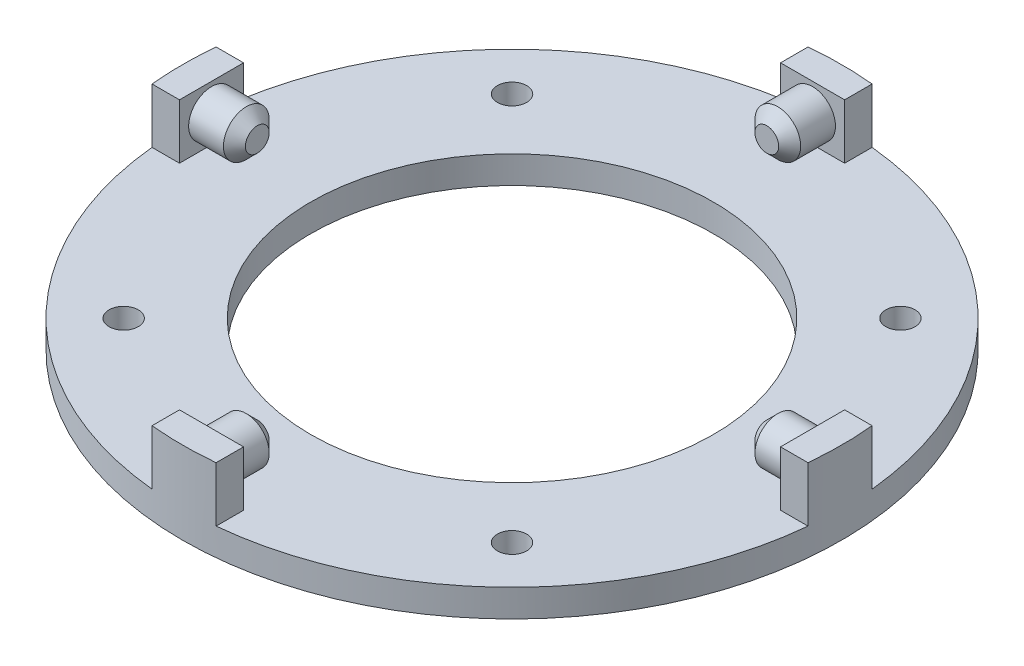
ISO-10303-21;
HEADER;
FILE_DESCRIPTION(('STEP AP214'),'2;1');
FILE_NAME('part.step','',(''),(''),'','','');
FILE_SCHEMA(('AUTOMOTIVE_DESIGN { 1 0 10303 214 1 1 1 1 }'));
ENDSEC;
DATA;
#1=APPLICATION_CONTEXT('core data for automotive mechanical design processes');
#2=APPLICATION_PROTOCOL_DEFINITION('international standard','automotive_design',2000,#1);
#3=PRODUCT_CONTEXT('',#1,'mechanical');
#4=PRODUCT('Part','Part','',(#3));
#5=PRODUCT_RELATED_PRODUCT_CATEGORY('part','',(#4));
#6=PRODUCT_DEFINITION_FORMATION('','',#4);
#7=PRODUCT_DEFINITION_CONTEXT('part definition',#1,'design');
#8=PRODUCT_DEFINITION('design','',#6,#7);
#9=PRODUCT_DEFINITION_SHAPE('','',#8);
#10=(LENGTH_UNIT() NAMED_UNIT(*) SI_UNIT(.MILLI.,.METRE.));
#11=(NAMED_UNIT(*) PLANE_ANGLE_UNIT() SI_UNIT($,.RADIAN.));
#12=(NAMED_UNIT(*) SI_UNIT($,.STERADIAN.) SOLID_ANGLE_UNIT());
#13=UNCERTAINTY_MEASURE_WITH_UNIT(LENGTH_MEASURE(1.E-05),#10,'distance_accuracy_value','');
#14=(GEOMETRIC_REPRESENTATION_CONTEXT(3) GLOBAL_UNCERTAINTY_ASSIGNED_CONTEXT((#13)) GLOBAL_UNIT_ASSIGNED_CONTEXT((#10,
#11,#12)) REPRESENTATION_CONTEXT('',''));
#15=CARTESIAN_POINT('',(0.,0.,0.));
#16=DIRECTION('',(0.,0.,1.));
#17=DIRECTION('',(1.,0.,0.));
#18=AXIS2_PLACEMENT_3D('',#15,#16,#17);
#19=CARTESIAN_POINT('',(0.,3.,0.));
#20=DIRECTION('',(0.,1.,0.));
#21=DIRECTION('',(0.,0.,1.));
#22=AXIS2_PLACEMENT_3D('',#19,#20,#21);
#23=PLANE('',#22);
#24=CARTESIAN_POINT('',(-21.2132034355965,3.,21.2132034355964));
#25=DIRECTION('',(0.,1.,0.));
#26=DIRECTION('',(1.,0.,0.));
#27=AXIS2_PLACEMENT_3D('',#24,#25,#26);
#28=CIRCLE('',#27,1.6);
#29=CARTESIAN_POINT('',(-19.6132034355965,3.,21.2132034355964));
#30=VERTEX_POINT('',#29);
#31=EDGE_CURVE('E495',#30,#30,#28,.T.);
#32=ORIENTED_EDGE('',*,*,#31,.F.);
#33=EDGE_LOOP('',(#32));
#34=FACE_BOUND('',#33,.T.);
#35=CARTESIAN_POINT('',(21.2132034355963,3.,21.2132034355965));
#36=DIRECTION('',(0.,1.,0.));
#37=DIRECTION('',(0.,0.,-1.));
#38=AXIS2_PLACEMENT_3D('',#35,#36,#37);
#39=CIRCLE('',#38,1.6);
#40=CARTESIAN_POINT('',(21.2132034355963,3.,19.6132034355965));
#41=VERTEX_POINT('',#40);
#42=EDGE_CURVE('E488',#41,#41,#39,.T.);
#43=ORIENTED_EDGE('',*,*,#42,.F.);
#44=EDGE_LOOP('',(#43));
#45=FACE_BOUND('',#44,.T.);
#46=CARTESIAN_POINT('',(21.2132034355963,3.,-21.2132034355965));
#47=DIRECTION('',(0.,1.,0.));
#48=DIRECTION('',(-1.,0.,0.));
#49=AXIS2_PLACEMENT_3D('',#46,#47,#48);
#50=CIRCLE('',#49,1.6);
#51=CARTESIAN_POINT('',(19.6132034355963,3.,-21.2132034355965));
#52=VERTEX_POINT('',#51);
#53=EDGE_CURVE('E489',#52,#52,#50,.T.);
#54=ORIENTED_EDGE('',*,*,#53,.F.);
#55=EDGE_LOOP('',(#54));
#56=FACE_BOUND('',#55,.T.);
#57=CARTESIAN_POINT('',(-21.2132034355963,3.,-21.2132034355965));
#58=DIRECTION('',(0.,1.,0.));
#59=DIRECTION('',(0.,0.,1.));
#60=AXIS2_PLACEMENT_3D('',#57,#58,#59);
#61=CIRCLE('',#60,1.6);
#62=CARTESIAN_POINT('',(-21.2132034355963,3.,-19.6132034355965));
#63=VERTEX_POINT('',#62);
#64=EDGE_CURVE('E477',#63,#63,#61,.T.);
#65=ORIENTED_EDGE('',*,*,#64,.F.);
#66=EDGE_LOOP('',(#65));
#67=FACE_BOUND('',#66,.T.);
#68=CARTESIAN_POINT('',(0.,3.,0.));
#69=DIRECTION('',(0.,1.,0.));
#70=DIRECTION('',(0.,0.,1.));
#71=AXIS2_PLACEMENT_3D('',#68,#69,#70);
#72=CIRCLE('',#71,22.);
#73=CARTESIAN_POINT('',(0.,3.,22.));
#74=VERTEX_POINT('',#73);
#75=EDGE_CURVE('E268',#74,#74,#72,.T.);
#76=ORIENTED_EDGE('',*,*,#75,.F.);
#77=EDGE_LOOP('',(#76));
#78=FACE_BOUND('',#77,.T.);
#79=DIRECTION('',(-1.,0.,0.));
#80=VECTOR('',#79,1.);
#81=CARTESIAN_POINT('',(-3.50000000000034,3.,32.8294571546932));
#82=LINE('',#81,#80);
#83=CARTESIAN_POINT('',(3.49999999999966,3.,32.8294571546933));
#84=VERTEX_POINT('',#83);
#85=CARTESIAN_POINT('',(-3.50000000000034,3.,32.8294571546932));
#86=VERTEX_POINT('',#85);
#87=EDGE_CURVE('E51',#84,#86,#82,.T.);
#88=ORIENTED_EDGE('',*,*,#87,.F.);
#89=DIRECTION('',(0.,0.,-1.));
#90=VECTOR('',#89,1.);
#91=CARTESIAN_POINT('',(3.49999999999966,3.,32.8294571546933));
#92=LINE('',#91,#90);
#93=CARTESIAN_POINT('',(3.49999999999962,3.,35.8294571546933));
#94=VERTEX_POINT('',#93);
#95=EDGE_CURVE('E469',#94,#84,#92,.T.);
#96=ORIENTED_EDGE('',*,*,#95,.F.);
#97=CARTESIAN_POINT('',(0.,3.,0.));
#98=DIRECTION('',(0.,1.,0.));
#99=DIRECTION('',(0.,0.,1.));
#100=AXIS2_PLACEMENT_3D('',#97,#98,#99);
#101=CIRCLE('',#100,36.);
#102=CARTESIAN_POINT('',(35.8294571546933,3.,3.5));
#103=VERTEX_POINT('',#102);
#104=EDGE_CURVE('E172',#94,#103,#101,.T.);
#105=ORIENTED_EDGE('',*,*,#104,.T.);
#106=DIRECTION('',(1.,0.,0.));
#107=VECTOR('',#106,1.);
#108=CARTESIAN_POINT('',(32.8294571546933,3.,3.5));
#109=LINE('',#108,#107);
#110=CARTESIAN_POINT('',(32.8294571546933,3.,3.5));
#111=VERTEX_POINT('',#110);
#112=EDGE_CURVE('E186',#111,#103,#109,.T.);
#113=ORIENTED_EDGE('',*,*,#112,.F.);
#114=DIRECTION('',(0.,0.,1.));
#115=VECTOR('',#114,1.);
#116=CARTESIAN_POINT('',(32.8294571546933,3.,3.5));
#117=LINE('',#116,#115);
#118=CARTESIAN_POINT('',(32.8294571546933,3.,-3.5));
#119=VERTEX_POINT('',#118);
#120=EDGE_CURVE('E176',#119,#111,#117,.T.);
#121=ORIENTED_EDGE('',*,*,#120,.F.);
#122=DIRECTION('',(-1.,0.,0.));
#123=VECTOR('',#122,1.);
#124=CARTESIAN_POINT('',(32.8294571546933,3.,-3.5));
#125=LINE('',#124,#123);
#126=CARTESIAN_POINT('',(35.8294571546933,3.,-3.5));
#127=VERTEX_POINT('',#126);
#128=EDGE_CURVE('E173',#127,#119,#125,.T.);
#129=ORIENTED_EDGE('',*,*,#128,.F.);
#130=CARTESIAN_POINT('',(3.50000000000012,3.,-35.8294571546932));
#131=VERTEX_POINT('',#130);
#132=EDGE_CURVE('E760',#127,#131,#101,.T.);
#133=ORIENTED_EDGE('',*,*,#132,.T.);
#134=DIRECTION('',(0.,0.,-1.));
#135=VECTOR('',#134,1.);
#136=CARTESIAN_POINT('',(3.50000000000011,3.,-32.8294571546932));
#137=LINE('',#136,#135);
#138=CARTESIAN_POINT('',(3.50000000000011,3.,-32.8294571546932));
#139=VERTEX_POINT('',#138);
#140=EDGE_CURVE('E212',#139,#131,#137,.T.);
#141=ORIENTED_EDGE('',*,*,#140,.F.);
#142=DIRECTION('',(1.,0.,0.));
#143=VECTOR('',#142,1.);
#144=CARTESIAN_POINT('',(3.50000000000011,3.,-32.8294571546932));
#145=LINE('',#144,#143);
#146=CARTESIAN_POINT('',(-3.49999999999989,3.,-32.8294571546933));
#147=VERTEX_POINT('',#146);
#148=EDGE_CURVE('E221',#147,#139,#145,.T.);
#149=ORIENTED_EDGE('',*,*,#148,.F.);
#150=DIRECTION('',(0.,0.,1.));
#151=VECTOR('',#150,1.);
#152=CARTESIAN_POINT('',(-3.49999999999989,3.,-32.8294571546933));
#153=LINE('',#152,#151);
#154=CARTESIAN_POINT('',(-3.49999999999988,3.,-35.8294571546933));
#155=VERTEX_POINT('',#154);
#156=EDGE_CURVE('E207',#155,#147,#153,.T.);
#157=ORIENTED_EDGE('',*,*,#156,.F.);
#158=CARTESIAN_POINT('',(-35.8294571546933,3.,-3.5));
#159=VERTEX_POINT('',#158);
#160=EDGE_CURVE('E277',#155,#159,#101,.T.);
#161=ORIENTED_EDGE('',*,*,#160,.T.);
#162=DIRECTION('',(-1.,0.,0.));
#163=VECTOR('',#162,1.);
#164=CARTESIAN_POINT('',(-32.8294571546933,3.,-3.5));
#165=LINE('',#164,#163);
#166=CARTESIAN_POINT('',(-32.8294571546933,3.,-3.5));
#167=VERTEX_POINT('',#166);
#168=EDGE_CURVE('E242',#167,#159,#165,.T.);
#169=ORIENTED_EDGE('',*,*,#168,.F.);
#170=DIRECTION('',(0.,0.,-1.));
#171=VECTOR('',#170,1.);
#172=CARTESIAN_POINT('',(-32.8294571546933,3.,-3.5));
#173=LINE('',#172,#171);
#174=CARTESIAN_POINT('',(-32.8294571546933,3.,3.5));
#175=VERTEX_POINT('',#174);
#176=EDGE_CURVE('E251',#175,#167,#173,.T.);
#177=ORIENTED_EDGE('',*,*,#176,.F.);
#178=DIRECTION('',(1.,0.,0.));
#179=VECTOR('',#178,1.);
#180=CARTESIAN_POINT('',(-32.8294571546933,3.,3.5));
#181=LINE('',#180,#179);
#182=CARTESIAN_POINT('',(-35.8294571546933,3.,3.5));
#183=VERTEX_POINT('',#182);
#184=EDGE_CURVE('E237',#183,#175,#181,.T.);
#185=ORIENTED_EDGE('',*,*,#184,.F.);
#186=CARTESIAN_POINT('',(-3.50000000000038,3.,35.8294571546932));
#187=VERTEX_POINT('',#186);
#188=EDGE_CURVE('E274',#183,#187,#101,.T.);
#189=ORIENTED_EDGE('',*,*,#188,.T.);
#190=DIRECTION('',(0.,0.,1.));
#191=VECTOR('',#190,1.);
#192=CARTESIAN_POINT('',(-3.50000000000034,3.,32.8294571546932));
#193=LINE('',#192,#191);
#194=EDGE_CURVE('E56',#86,#187,#193,.T.);
#195=ORIENTED_EDGE('',*,*,#194,.F.);
#196=EDGE_LOOP('',(#88,#96,#105,#113,#121,#129,#133,#141,#149,#157,#161,#169,#177,#185,#189,#195));
#197=FACE_BOUND('',#196,.T.);
#198=ADVANCED_FACE('F35',(#34,#45,#56,#67,#78,#197),#23,.T.);
#199=CARTESIAN_POINT('',(0.,0.,0.));
#200=DIRECTION('',(0.,1.,0.));
#201=DIRECTION('',(0.,0.,1.));
#202=AXIS2_PLACEMENT_3D('',#199,#200,#201);
#203=PLANE('',#202);
#204=CARTESIAN_POINT('',(-21.2132034355965,0.,21.2132034355964));
#205=DIRECTION('',(0.,1.,0.));
#206=DIRECTION('',(0.,0.,1.));
#207=AXIS2_PLACEMENT_3D('',#204,#205,#206);
#208=CIRCLE('',#207,1.6);
#209=CARTESIAN_POINT('',(-21.2132034355965,0.,22.8132034355964));
#210=VERTEX_POINT('',#209);
#211=EDGE_CURVE('E482',#210,#210,#208,.F.);
#212=ORIENTED_EDGE('',*,*,#211,.F.);
#213=EDGE_LOOP('',(#212));
#214=FACE_BOUND('',#213,.T.);
#215=CARTESIAN_POINT('',(21.2132034355963,0.,21.2132034355965));
#216=DIRECTION('',(0.,1.,0.));
#217=DIRECTION('',(0.,0.,1.));
#218=AXIS2_PLACEMENT_3D('',#215,#216,#217);
#219=CIRCLE('',#218,1.6);
#220=CARTESIAN_POINT('',(21.2132034355963,0.,22.8132034355965));
#221=VERTEX_POINT('',#220);
#222=EDGE_CURVE('E492',#221,#221,#219,.F.);
#223=ORIENTED_EDGE('',*,*,#222,.F.);
#224=EDGE_LOOP('',(#223));
#225=FACE_BOUND('',#224,.T.);
#226=CARTESIAN_POINT('',(21.2132034355963,0.,-21.2132034355965));
#227=DIRECTION('',(0.,1.,0.));
#228=DIRECTION('',(0.,0.,1.));
#229=AXIS2_PLACEMENT_3D('',#226,#227,#228);
#230=CIRCLE('',#229,1.6);
#231=CARTESIAN_POINT('',(21.2132034355963,0.,-19.6132034355965));
#232=VERTEX_POINT('',#231);
#233=EDGE_CURVE('E485',#232,#232,#230,.F.);
#234=ORIENTED_EDGE('',*,*,#233,.F.);
#235=EDGE_LOOP('',(#234));
#236=FACE_BOUND('',#235,.T.);
#237=CARTESIAN_POINT('',(-21.2132034355963,0.,-21.2132034355965));
#238=DIRECTION('',(0.,1.,0.));
#239=DIRECTION('',(0.,0.,1.));
#240=AXIS2_PLACEMENT_3D('',#237,#238,#239);
#241=CIRCLE('',#240,1.6);
#242=CARTESIAN_POINT('',(-21.2132034355963,0.,-19.6132034355965));
#243=VERTEX_POINT('',#242);
#244=EDGE_CURVE('E475',#243,#243,#241,.F.);
#245=ORIENTED_EDGE('',*,*,#244,.F.);
#246=EDGE_LOOP('',(#245));
#247=FACE_BOUND('',#246,.T.);
#248=CARTESIAN_POINT('',(0.,0.,0.));
#249=DIRECTION('',(0.,1.,0.));
#250=DIRECTION('',(0.,0.,1.));
#251=AXIS2_PLACEMENT_3D('',#248,#249,#250);
#252=CIRCLE('',#251,36.);
#253=CARTESIAN_POINT('',(0.,0.,36.));
#254=VERTEX_POINT('',#253);
#255=EDGE_CURVE('E271',#254,#254,#252,.T.);
#256=ORIENTED_EDGE('',*,*,#255,.F.);
#257=EDGE_LOOP('',(#256));
#258=FACE_BOUND('',#257,.T.);
#259=CARTESIAN_POINT('',(0.,0.,0.));
#260=DIRECTION('',(0.,1.,0.));
#261=DIRECTION('',(0.,0.,1.));
#262=AXIS2_PLACEMENT_3D('',#259,#260,#261);
#263=CIRCLE('',#262,22.);
#264=CARTESIAN_POINT('',(0.,0.,22.));
#265=VERTEX_POINT('',#264);
#266=EDGE_CURVE('E267',#265,#265,#263,.T.);
#267=ORIENTED_EDGE('',*,*,#266,.T.);
#268=EDGE_LOOP('',(#267));
#269=FACE_BOUND('',#268,.T.);
#270=ADVANCED_FACE('F328',(#214,#225,#236,#247,#258,#269),#203,.F.);
#271=CARTESIAN_POINT('',(0.,3.,0.));
#272=DIRECTION('',(0.,-1.,0.));
#273=DIRECTION('',(0.,0.,-1.));
#274=AXIS2_PLACEMENT_3D('',#271,#272,#273);
#275=CYLINDRICAL_SURFACE('',#274,36.);
#276=ORIENTED_EDGE('',*,*,#188,.F.);
#277=DIRECTION('',(0.,-1.,0.));
#278=VECTOR('',#277,1.);
#279=CARTESIAN_POINT('',(-35.8294571546933,9.,3.5));
#280=LINE('',#279,#278);
#281=CARTESIAN_POINT('',(-35.8294571546933,9.,3.5));
#282=VERTEX_POINT('',#281);
#283=EDGE_CURVE('E264',#282,#183,#280,.T.);
#284=ORIENTED_EDGE('',*,*,#283,.F.);
#285=CARTESIAN_POINT('',(0.,9.,0.));
#286=DIRECTION('',(0.,1.,0.));
#287=DIRECTION('',(0.,0.,1.));
#288=AXIS2_PLACEMENT_3D('',#285,#286,#287);
#289=CIRCLE('',#288,36.);
#290=CARTESIAN_POINT('',(-35.8294571546933,9.,-3.5));
#291=VERTEX_POINT('',#290);
#292=EDGE_CURVE('E238',#291,#282,#289,.T.);
#293=ORIENTED_EDGE('',*,*,#292,.F.);
#294=DIRECTION('',(0.,-1.,0.));
#295=VECTOR('',#294,1.);
#296=CARTESIAN_POINT('',(-35.8294571546933,9.,-3.5));
#297=LINE('',#296,#295);
#298=EDGE_CURVE('E248',#291,#159,#297,.T.);
#299=ORIENTED_EDGE('',*,*,#298,.T.);
#300=ORIENTED_EDGE('',*,*,#160,.F.);
#301=DIRECTION('',(0.,-1.,0.));
#302=VECTOR('',#301,1.);
#303=CARTESIAN_POINT('',(-3.49999999999988,9.,-35.8294571546933));
#304=LINE('',#303,#302);
#305=CARTESIAN_POINT('',(-3.49999999999988,9.,-35.8294571546933));
#306=VERTEX_POINT('',#305);
#307=EDGE_CURVE('E234',#306,#155,#304,.T.);
#308=ORIENTED_EDGE('',*,*,#307,.F.);
#309=CARTESIAN_POINT('',(0.,9.,0.));
#310=DIRECTION('',(0.,1.,0.));
#311=DIRECTION('',(-1.,0.,0.));
#312=AXIS2_PLACEMENT_3D('',#309,#310,#311);
#313=CIRCLE('',#312,36.);
#314=CARTESIAN_POINT('',(3.50000000000012,9.,-35.8294571546932));
#315=VERTEX_POINT('',#314);
#316=EDGE_CURVE('E208',#315,#306,#313,.T.);
#317=ORIENTED_EDGE('',*,*,#316,.F.);
#318=DIRECTION('',(0.,-1.,0.));
#319=VECTOR('',#318,1.);
#320=CARTESIAN_POINT('',(3.50000000000012,9.,-35.8294571546932));
#321=LINE('',#320,#319);
#322=EDGE_CURVE('E218',#315,#131,#321,.T.);
#323=ORIENTED_EDGE('',*,*,#322,.T.);
#324=ORIENTED_EDGE('',*,*,#132,.F.);
#325=DIRECTION('',(0.,-1.,0.));
#326=VECTOR('',#325,1.);
#327=CARTESIAN_POINT('',(35.8294571546933,9.,-3.5));
#328=LINE('',#327,#326);
#329=CARTESIAN_POINT('',(35.8294571546933,9.,-3.5));
#330=VERTEX_POINT('',#329);
#331=EDGE_CURVE('E204',#330,#127,#328,.T.);
#332=ORIENTED_EDGE('',*,*,#331,.F.);
#333=CARTESIAN_POINT('',(0.,9.,0.));
#334=DIRECTION('',(0.,1.,0.));
#335=DIRECTION('',(0.,0.,-1.));
#336=AXIS2_PLACEMENT_3D('',#333,#334,#335);
#337=CIRCLE('',#336,36.);
#338=CARTESIAN_POINT('',(35.8294571546933,9.,3.5));
#339=VERTEX_POINT('',#338);
#340=EDGE_CURVE('E182',#339,#330,#337,.T.);
#341=ORIENTED_EDGE('',*,*,#340,.F.);
#342=DIRECTION('',(0.,-1.,0.));
#343=VECTOR('',#342,1.);
#344=CARTESIAN_POINT('',(35.8294571546933,9.,3.5));
#345=LINE('',#344,#343);
#346=EDGE_CURVE('E191',#339,#103,#345,.T.);
#347=ORIENTED_EDGE('',*,*,#346,.T.);
#348=ORIENTED_EDGE('',*,*,#104,.F.);
#349=DIRECTION('',(0.,-1.,0.));
#350=VECTOR('',#349,1.);
#351=CARTESIAN_POINT('',(3.49999999999962,9.,35.8294571546933));
#352=LINE('',#351,#350);
#353=CARTESIAN_POINT('',(3.49999999999962,9.,35.8294571546933));
#354=VERTEX_POINT('',#353);
#355=EDGE_CURVE('E152',#354,#94,#352,.T.);
#356=ORIENTED_EDGE('',*,*,#355,.F.);
#357=CARTESIAN_POINT('',(0.,9.,0.));
#358=DIRECTION('',(0.,1.,0.));
#359=DIRECTION('',(1.,0.,0.));
#360=AXIS2_PLACEMENT_3D('',#357,#358,#359);
#361=CIRCLE('',#360,36.);
#362=CARTESIAN_POINT('',(-3.50000000000038,9.,35.8294571546932));
#363=VERTEX_POINT('',#362);
#364=EDGE_CURVE('E158',#363,#354,#361,.T.);
#365=ORIENTED_EDGE('',*,*,#364,.F.);
#366=DIRECTION('',(0.,-1.,0.));
#367=VECTOR('',#366,1.);
#368=CARTESIAN_POINT('',(-3.50000000000038,9.,35.8294571546932));
#369=LINE('',#368,#367);
#370=EDGE_CURVE('E465',#363,#187,#369,.T.);
#371=ORIENTED_EDGE('',*,*,#370,.T.);
#372=EDGE_LOOP('',(#276,#284,#293,#299,#300,#308,#317,#323,#324,#332,#341,#347,#348,#356,#365,#371));
#373=FACE_BOUND('',#372,.T.);
#374=ORIENTED_EDGE('',*,*,#255,.T.);
#375=EDGE_LOOP('',(#374));
#376=FACE_BOUND('',#375,.T.);
#377=ADVANCED_FACE('F169',(#373,#376),#275,.T.);
#378=CARTESIAN_POINT('',(0.,3.,0.));
#379=DIRECTION('',(0.,-1.,0.));
#380=DIRECTION('',(0.,0.,-1.));
#381=AXIS2_PLACEMENT_3D('',#378,#379,#380);
#382=CYLINDRICAL_SURFACE('',#381,22.);
#383=ORIENTED_EDGE('',*,*,#75,.T.);
#384=EDGE_LOOP('',(#383));
#385=FACE_BOUND('',#384,.T.);
#386=ORIENTED_EDGE('',*,*,#266,.F.);
#387=EDGE_LOOP('',(#386));
#388=FACE_BOUND('',#387,.T.);
#389=ADVANCED_FACE('F340',(#385,#388),#382,.F.);
#390=CARTESIAN_POINT('',(-32.8294571546933,9.,3.5));
#391=DIRECTION('',(0.,0.,-1.));
#392=DIRECTION('',(-1.,0.,0.));
#393=AXIS2_PLACEMENT_3D('',#390,#391,#392);
#394=PLANE('',#393);
#395=ORIENTED_EDGE('',*,*,#184,.T.);
#396=DIRECTION('',(0.,-1.,0.));
#397=VECTOR('',#396,1.);
#398=CARTESIAN_POINT('',(-32.8294571546933,9.,3.5));
#399=LINE('',#398,#397);
#400=CARTESIAN_POINT('',(-32.8294571546933,9.,3.5));
#401=VERTEX_POINT('',#400);
#402=EDGE_CURVE('E261',#401,#175,#399,.T.);
#403=ORIENTED_EDGE('',*,*,#402,.F.);
#404=DIRECTION('',(1.,0.,0.));
#405=VECTOR('',#404,1.);
#406=CARTESIAN_POINT('',(-32.8294571546933,9.,3.5));
#407=LINE('',#406,#405);
#408=EDGE_CURVE('E241',#282,#401,#407,.T.);
#409=ORIENTED_EDGE('',*,*,#408,.F.);
#410=ORIENTED_EDGE('',*,*,#283,.T.);
#411=EDGE_LOOP('',(#395,#403,#409,#410));
#412=FACE_BOUND('',#411,.T.);
#413=ADVANCED_FACE('F449',(#412),#394,.F.);
#414=CARTESIAN_POINT('',(-32.8294571546933,9.,-3.5));
#415=DIRECTION('',(-1.,0.,0.));
#416=DIRECTION('',(0.,0.,1.));
#417=AXIS2_PLACEMENT_3D('',#414,#415,#416);
#418=PLANE('',#417);
#419=CARTESIAN_POINT('',(-32.8294571546933,6.,0.));
#420=DIRECTION('',(-1.,0.,0.));
#421=DIRECTION('',(0.,0.,1.));
#422=AXIS2_PLACEMENT_3D('',#419,#420,#421);
#423=CIRCLE('',#422,2.5);
#424=CARTESIAN_POINT('',(-32.8294571546933,6.,2.5));
#425=VERTEX_POINT('',#424);
#426=EDGE_CURVE('E276',#425,#425,#423,.F.);
#427=ORIENTED_EDGE('',*,*,#426,.F.);
#428=EDGE_LOOP('',(#427));
#429=FACE_BOUND('',#428,.T.);
#430=ORIENTED_EDGE('',*,*,#176,.T.);
#431=DIRECTION('',(0.,-1.,0.));
#432=VECTOR('',#431,1.);
#433=CARTESIAN_POINT('',(-32.8294571546933,9.,-3.5));
#434=LINE('',#433,#432);
#435=CARTESIAN_POINT('',(-32.8294571546933,9.,-3.5));
#436=VERTEX_POINT('',#435);
#437=EDGE_CURVE('E258',#436,#167,#434,.T.);
#438=ORIENTED_EDGE('',*,*,#437,.F.);
#439=DIRECTION('',(0.,0.,-1.));
#440=VECTOR('',#439,1.);
#441=CARTESIAN_POINT('',(-32.8294571546933,9.,-3.5));
#442=LINE('',#441,#440);
#443=EDGE_CURVE('E244',#401,#436,#442,.T.);
#444=ORIENTED_EDGE('',*,*,#443,.F.);
#445=ORIENTED_EDGE('',*,*,#402,.T.);
#446=EDGE_LOOP('',(#430,#438,#444,#445));
#447=FACE_BOUND('',#446,.T.);
#448=ADVANCED_FACE('F446',(#429,#447),#418,.F.);
#449=CARTESIAN_POINT('',(-32.8294571546933,9.,-3.5));
#450=DIRECTION('',(0.,0.,1.));
#451=DIRECTION('',(1.,0.,0.));
#452=AXIS2_PLACEMENT_3D('',#449,#450,#451);
#453=PLANE('',#452);
#454=ORIENTED_EDGE('',*,*,#168,.T.);
#455=ORIENTED_EDGE('',*,*,#298,.F.);
#456=DIRECTION('',(-1.,0.,0.));
#457=VECTOR('',#456,1.);
#458=CARTESIAN_POINT('',(-32.8294571546933,9.,-3.5));
#459=LINE('',#458,#457);
#460=EDGE_CURVE('E246',#436,#291,#459,.T.);
#461=ORIENTED_EDGE('',*,*,#460,.F.);
#462=ORIENTED_EDGE('',*,*,#437,.T.);
#463=EDGE_LOOP('',(#454,#455,#461,#462));
#464=FACE_BOUND('',#463,.T.);
#465=ADVANCED_FACE('F442',(#464),#453,.F.);
#466=CARTESIAN_POINT('',(0.,9.,0.));
#467=DIRECTION('',(0.,1.,0.));
#468=DIRECTION('',(0.,0.,1.));
#469=AXIS2_PLACEMENT_3D('',#466,#467,#468);
#470=PLANE('',#469);
#471=ORIENTED_EDGE('',*,*,#292,.T.);
#472=ORIENTED_EDGE('',*,*,#408,.T.);
#473=ORIENTED_EDGE('',*,*,#443,.T.);
#474=ORIENTED_EDGE('',*,*,#460,.T.);
#475=EDGE_LOOP('',(#471,#472,#473,#474));
#476=FACE_BOUND('',#475,.T.);
#477=ADVANCED_FACE('F438',(#476),#470,.T.);
#478=CARTESIAN_POINT('',(-27.8294571546932,6.,0.));
#479=DIRECTION('',(-1.,0.,0.));
#480=DIRECTION('',(0.,0.,1.));
#481=AXIS2_PLACEMENT_3D('',#478,#479,#480);
#482=CYLINDRICAL_SURFACE('',#481,2.5);
#483=CARTESIAN_POINT('',(-29.0294571546933,6.,0.));
#484=DIRECTION('',(1.,0.,0.));
#485=DIRECTION('',(0.,0.,-1.));
#486=AXIS2_PLACEMENT_3D('',#483,#484,#485);
#487=CIRCLE('',#486,2.5);
#488=CARTESIAN_POINT('',(-29.0294571546933,6.,-2.5));
#489=VERTEX_POINT('',#488);
#490=EDGE_CURVE('E285',#489,#489,#487,.F.);
#491=ORIENTED_EDGE('',*,*,#490,.T.);
#492=EDGE_LOOP('',(#491));
#493=FACE_BOUND('',#492,.T.);
#494=ORIENTED_EDGE('',*,*,#426,.T.);
#495=EDGE_LOOP('',(#494));
#496=FACE_BOUND('',#495,.T.);
#497=ADVANCED_FACE('F434',(#493,#496),#482,.T.);
#498=CARTESIAN_POINT('',(-27.8294571546932,6.,0.));
#499=DIRECTION('',(1.,0.,0.));
#500=DIRECTION('',(0.,0.,-1.));
#501=AXIS2_PLACEMENT_3D('',#498,#499,#500);
#502=PLANE('',#501);
#503=CARTESIAN_POINT('',(-27.8294571546932,6.,0.));
#504=DIRECTION('',(1.,0.,0.));
#505=DIRECTION('',(0.,0.,-1.));
#506=AXIS2_PLACEMENT_3D('',#503,#504,#505);
#507=CIRCLE('',#506,1.3);
#508=CARTESIAN_POINT('',(-27.8294571546932,6.,-1.3));
#509=VERTEX_POINT('',#508);
#510=EDGE_CURVE('E282',#509,#509,#507,.T.);
#511=ORIENTED_EDGE('',*,*,#510,.T.);
#512=EDGE_LOOP('',(#511));
#513=FACE_BOUND('',#512,.T.);
#514=ADVANCED_FACE('F353',(#513),#502,.T.);
#515=CARTESIAN_POINT('',(-27.8294571546932,6.,0.));
#516=DIRECTION('',(-1.,0.,0.));
#517=DIRECTION('',(0.,0.,1.));
#518=AXIS2_PLACEMENT_3D('',#515,#516,#517);
#519=CONICAL_SURFACE('',#518,1.3,0.785398163397445);
#520=ORIENTED_EDGE('',*,*,#490,.F.);
#521=EDGE_LOOP('',(#520));
#522=FACE_BOUND('',#521,.T.);
#523=ORIENTED_EDGE('',*,*,#510,.F.);
#524=EDGE_LOOP('',(#523));
#525=FACE_BOUND('',#524,.T.);
#526=ADVANCED_FACE('F346',(#522,#525),#519,.T.);
#527=CARTESIAN_POINT('',(-3.49999999999989,9.,-32.8294571546933));
#528=DIRECTION('',(1.,0.,0.));
#529=DIRECTION('',(0.,0.,-1.));
#530=AXIS2_PLACEMENT_3D('',#527,#528,#529);
#531=PLANE('',#530);
#532=ORIENTED_EDGE('',*,*,#156,.T.);
#533=DIRECTION('',(0.,-1.,0.));
#534=VECTOR('',#533,1.);
#535=CARTESIAN_POINT('',(-3.49999999999989,9.,-32.8294571546933));
#536=LINE('',#535,#534);
#537=CARTESIAN_POINT('',(-3.49999999999989,9.,-32.8294571546933));
#538=VERTEX_POINT('',#537);
#539=EDGE_CURVE('E231',#538,#147,#536,.T.);
#540=ORIENTED_EDGE('',*,*,#539,.F.);
#541=DIRECTION('',(0.,0.,1.));
#542=VECTOR('',#541,1.);
#543=CARTESIAN_POINT('',(-3.49999999999989,9.,-32.8294571546933));
#544=LINE('',#543,#542);
#545=EDGE_CURVE('E211',#306,#538,#544,.T.);
#546=ORIENTED_EDGE('',*,*,#545,.F.);
#547=ORIENTED_EDGE('',*,*,#307,.T.);
#548=EDGE_LOOP('',(#532,#540,#546,#547));
#549=FACE_BOUND('',#548,.T.);
#550=ADVANCED_FACE('F352',(#549),#531,.F.);
#551=CARTESIAN_POINT('',(3.50000000000011,9.,-32.8294571546932));
#552=DIRECTION('',(0.,0.,-1.));
#553=DIRECTION('',(-1.,0.,0.));
#554=AXIS2_PLACEMENT_3D('',#551,#552,#553);
#555=PLANE('',#554);
#556=CARTESIAN_POINT('',(1.14623437019962E-13,6.,-32.8294571546933));
#557=DIRECTION('',(0.,0.,-1.));
#558=DIRECTION('',(-1.,0.,0.));
#559=AXIS2_PLACEMENT_3D('',#556,#557,#558);
#560=CIRCLE('',#559,2.5);
#561=CARTESIAN_POINT('',(-2.49999999999989,6.,-32.8294571546933));
#562=VERTEX_POINT('',#561);
#563=EDGE_CURVE('E288',#562,#562,#560,.F.);
#564=ORIENTED_EDGE('',*,*,#563,.F.);
#565=EDGE_LOOP('',(#564));
#566=FACE_BOUND('',#565,.T.);
#567=ORIENTED_EDGE('',*,*,#148,.T.);
#568=DIRECTION('',(0.,-1.,0.));
#569=VECTOR('',#568,1.);
#570=CARTESIAN_POINT('',(3.50000000000011,9.,-32.8294571546932));
#571=LINE('',#570,#569);
#572=CARTESIAN_POINT('',(3.50000000000011,9.,-32.8294571546932));
#573=VERTEX_POINT('',#572);
#574=EDGE_CURVE('E228',#573,#139,#571,.T.);
#575=ORIENTED_EDGE('',*,*,#574,.F.);
#576=DIRECTION('',(1.,0.,0.));
#577=VECTOR('',#576,1.);
#578=CARTESIAN_POINT('',(3.50000000000011,9.,-32.8294571546932));
#579=LINE('',#578,#577);
#580=EDGE_CURVE('E214',#538,#573,#579,.T.);
#581=ORIENTED_EDGE('',*,*,#580,.F.);
#582=ORIENTED_EDGE('',*,*,#539,.T.);
#583=EDGE_LOOP('',(#567,#575,#581,#582));
#584=FACE_BOUND('',#583,.T.);
#585=ADVANCED_FACE('F424',(#566,#584),#555,.F.);
#586=CARTESIAN_POINT('',(3.50000000000011,9.,-32.8294571546932));
#587=DIRECTION('',(-1.,0.,0.));
#588=DIRECTION('',(0.,0.,1.));
#589=AXIS2_PLACEMENT_3D('',#586,#587,#588);
#590=PLANE('',#589);
#591=ORIENTED_EDGE('',*,*,#140,.T.);
#592=ORIENTED_EDGE('',*,*,#322,.F.);
#593=DIRECTION('',(0.,0.,-1.));
#594=VECTOR('',#593,1.);
#595=CARTESIAN_POINT('',(3.50000000000011,9.,-32.8294571546932));
#596=LINE('',#595,#594);
#597=EDGE_CURVE('E216',#573,#315,#596,.T.);
#598=ORIENTED_EDGE('',*,*,#597,.F.);
#599=ORIENTED_EDGE('',*,*,#574,.T.);
#600=EDGE_LOOP('',(#591,#592,#598,#599));
#601=FACE_BOUND('',#600,.T.);
#602=ADVANCED_FACE('F420',(#601),#590,.F.);
#603=CARTESIAN_POINT('',(0.,9.,0.));
#604=DIRECTION('',(0.,1.,0.));
#605=DIRECTION('',(-1.,0.,0.));
#606=AXIS2_PLACEMENT_3D('',#603,#604,#605);
#607=PLANE('',#606);
#608=ORIENTED_EDGE('',*,*,#316,.T.);
#609=ORIENTED_EDGE('',*,*,#545,.T.);
#610=ORIENTED_EDGE('',*,*,#580,.T.);
#611=ORIENTED_EDGE('',*,*,#597,.T.);
#612=EDGE_LOOP('',(#608,#609,#610,#611));
#613=FACE_BOUND('',#612,.T.);
#614=ADVANCED_FACE('F416',(#613),#607,.T.);
#615=CARTESIAN_POINT('',(32.8294571546933,9.,-3.5));
#616=DIRECTION('',(0.,0.,1.));
#617=DIRECTION('',(1.,0.,0.));
#618=AXIS2_PLACEMENT_3D('',#615,#616,#617);
#619=PLANE('',#618);
#620=ORIENTED_EDGE('',*,*,#128,.T.);
#621=DIRECTION('',(0.,-1.,0.));
#622=VECTOR('',#621,1.);
#623=CARTESIAN_POINT('',(32.8294571546933,9.,-3.5));
#624=LINE('',#623,#622);
#625=CARTESIAN_POINT('',(32.8294571546933,9.,-3.5));
#626=VERTEX_POINT('',#625);
#627=EDGE_CURVE('E201',#626,#119,#624,.T.);
#628=ORIENTED_EDGE('',*,*,#627,.F.);
#629=DIRECTION('',(-1.,0.,0.));
#630=VECTOR('',#629,1.);
#631=CARTESIAN_POINT('',(32.8294571546933,9.,-3.5));
#632=LINE('',#631,#630);
#633=EDGE_CURVE('E185',#330,#626,#632,.T.);
#634=ORIENTED_EDGE('',*,*,#633,.F.);
#635=ORIENTED_EDGE('',*,*,#331,.T.);
#636=EDGE_LOOP('',(#620,#628,#634,#635));
#637=FACE_BOUND('',#636,.T.);
#638=ADVANCED_FACE('F412',(#637),#619,.F.);
#639=CARTESIAN_POINT('',(32.8294571546933,9.,3.5));
#640=DIRECTION('',(1.,0.,0.));
#641=DIRECTION('',(0.,0.,-1.));
#642=AXIS2_PLACEMENT_3D('',#639,#640,#641);
#643=PLANE('',#642);
#644=CARTESIAN_POINT('',(32.8294571546933,6.,0.));
#645=DIRECTION('',(1.,0.,0.));
#646=DIRECTION('',(0.,0.,-1.));
#647=AXIS2_PLACEMENT_3D('',#644,#645,#646);
#648=CIRCLE('',#647,2.5);
#649=CARTESIAN_POINT('',(32.8294571546933,6.,-2.5));
#650=VERTEX_POINT('',#649);
#651=EDGE_CURVE('E291',#650,#650,#648,.F.);
#652=ORIENTED_EDGE('',*,*,#651,.F.);
#653=EDGE_LOOP('',(#652));
#654=FACE_BOUND('',#653,.T.);
#655=ORIENTED_EDGE('',*,*,#120,.T.);
#656=DIRECTION('',(0.,-1.,0.));
#657=VECTOR('',#656,1.);
#658=CARTESIAN_POINT('',(32.8294571546933,9.,3.5));
#659=LINE('',#658,#657);
#660=CARTESIAN_POINT('',(32.8294571546933,9.,3.5));
#661=VERTEX_POINT('',#660);
#662=EDGE_CURVE('E198',#661,#111,#659,.T.);
#663=ORIENTED_EDGE('',*,*,#662,.F.);
#664=DIRECTION('',(0.,0.,1.));
#665=VECTOR('',#664,1.);
#666=CARTESIAN_POINT('',(32.8294571546933,9.,3.5));
#667=LINE('',#666,#665);
#668=EDGE_CURVE('E188',#626,#661,#667,.T.);
#669=ORIENTED_EDGE('',*,*,#668,.F.);
#670=ORIENTED_EDGE('',*,*,#627,.T.);
#671=EDGE_LOOP('',(#655,#663,#669,#670));
#672=FACE_BOUND('',#671,.T.);
#673=ADVANCED_FACE('F408',(#654,#672),#643,.F.);
#674=CARTESIAN_POINT('',(32.8294571546933,9.,3.5));
#675=DIRECTION('',(0.,0.,-1.));
#676=DIRECTION('',(-1.,0.,0.));
#677=AXIS2_PLACEMENT_3D('',#674,#675,#676);
#678=PLANE('',#677);
#679=ORIENTED_EDGE('',*,*,#112,.T.);
#680=ORIENTED_EDGE('',*,*,#346,.F.);
#681=DIRECTION('',(1.,0.,0.));
#682=VECTOR('',#681,1.);
#683=CARTESIAN_POINT('',(32.8294571546933,9.,3.5));
#684=LINE('',#683,#682);
#685=EDGE_CURVE('E190',#661,#339,#684,.T.);
#686=ORIENTED_EDGE('',*,*,#685,.F.);
#687=ORIENTED_EDGE('',*,*,#662,.T.);
#688=EDGE_LOOP('',(#679,#680,#686,#687));
#689=FACE_BOUND('',#688,.T.);
#690=ADVANCED_FACE('F404',(#689),#678,.F.);
#691=CARTESIAN_POINT('',(0.,9.,0.));
#692=DIRECTION('',(0.,1.,0.));
#693=DIRECTION('',(0.,0.,-1.));
#694=AXIS2_PLACEMENT_3D('',#691,#692,#693);
#695=PLANE('',#694);
#696=ORIENTED_EDGE('',*,*,#340,.T.);
#697=ORIENTED_EDGE('',*,*,#633,.T.);
#698=ORIENTED_EDGE('',*,*,#668,.T.);
#699=ORIENTED_EDGE('',*,*,#685,.T.);
#700=EDGE_LOOP('',(#696,#697,#698,#699));
#701=FACE_BOUND('',#700,.T.);
#702=ADVANCED_FACE('F401',(#701),#695,.T.);
#703=CARTESIAN_POINT('',(3.49999999999966,9.,32.8294571546933));
#704=DIRECTION('',(-1.,0.,0.));
#705=DIRECTION('',(0.,0.,1.));
#706=AXIS2_PLACEMENT_3D('',#703,#704,#705);
#707=PLANE('',#706);
#708=ORIENTED_EDGE('',*,*,#95,.T.);
#709=DIRECTION('',(0.,-1.,0.));
#710=VECTOR('',#709,1.);
#711=CARTESIAN_POINT('',(3.49999999999966,9.,32.8294571546933));
#712=LINE('',#711,#710);
#713=CARTESIAN_POINT('',(3.49999999999966,9.,32.8294571546933));
#714=VERTEX_POINT('',#713);
#715=EDGE_CURVE('E154',#714,#84,#712,.T.);
#716=ORIENTED_EDGE('',*,*,#715,.F.);
#717=DIRECTION('',(0.,0.,-1.));
#718=VECTOR('',#717,1.);
#719=CARTESIAN_POINT('',(3.49999999999966,9.,32.8294571546933));
#720=LINE('',#719,#718);
#721=EDGE_CURVE('E148',#354,#714,#720,.T.);
#722=ORIENTED_EDGE('',*,*,#721,.F.);
#723=ORIENTED_EDGE('',*,*,#355,.T.);
#724=EDGE_LOOP('',(#708,#716,#722,#723));
#725=FACE_BOUND('',#724,.T.);
#726=ADVANCED_FACE('F150',(#725),#707,.F.);
#727=CARTESIAN_POINT('',(-3.50000000000034,9.,32.8294571546932));
#728=DIRECTION('',(0.,0.,1.));
#729=DIRECTION('',(1.,0.,0.));
#730=AXIS2_PLACEMENT_3D('',#727,#728,#729);
#731=PLANE('',#730);
#732=CARTESIAN_POINT('',(-3.43870311059885E-13,6.,32.8294571546933));
#733=DIRECTION('',(0.,0.,1.));
#734=DIRECTION('',(1.,0.,0.));
#735=AXIS2_PLACEMENT_3D('',#732,#733,#734);
#736=CIRCLE('',#735,2.5);
#737=CARTESIAN_POINT('',(2.49999999999966,6.,32.8294571546933));
#738=VERTEX_POINT('',#737);
#739=EDGE_CURVE('E294',#738,#738,#736,.F.);
#740=ORIENTED_EDGE('',*,*,#739,.F.);
#741=EDGE_LOOP('',(#740));
#742=FACE_BOUND('',#741,.T.);
#743=ORIENTED_EDGE('',*,*,#87,.T.);
#744=DIRECTION('',(0.,-1.,0.));
#745=VECTOR('',#744,1.);
#746=CARTESIAN_POINT('',(-3.50000000000034,9.,32.8294571546932));
#747=LINE('',#746,#745);
#748=CARTESIAN_POINT('',(-3.50000000000034,9.,32.8294571546932));
#749=VERTEX_POINT('',#748);
#750=EDGE_CURVE('E178',#749,#86,#747,.T.);
#751=ORIENTED_EDGE('',*,*,#750,.F.);
#752=DIRECTION('',(-1.,0.,0.));
#753=VECTOR('',#752,1.);
#754=CARTESIAN_POINT('',(-3.50000000000034,9.,32.8294571546932));
#755=LINE('',#754,#753);
#756=EDGE_CURVE('E157',#714,#749,#755,.T.);
#757=ORIENTED_EDGE('',*,*,#756,.F.);
#758=ORIENTED_EDGE('',*,*,#715,.T.);
#759=EDGE_LOOP('',(#743,#751,#757,#758));
#760=FACE_BOUND('',#759,.T.);
#761=ADVANCED_FACE('F394',(#742,#760),#731,.F.);
#762=CARTESIAN_POINT('',(-3.50000000000034,9.,32.8294571546932));
#763=DIRECTION('',(1.,0.,0.));
#764=DIRECTION('',(0.,0.,-1.));
#765=AXIS2_PLACEMENT_3D('',#762,#763,#764);
#766=PLANE('',#765);
#767=ORIENTED_EDGE('',*,*,#194,.T.);
#768=ORIENTED_EDGE('',*,*,#370,.F.);
#769=DIRECTION('',(0.,0.,1.));
#770=VECTOR('',#769,1.);
#771=CARTESIAN_POINT('',(-3.50000000000034,9.,32.8294571546932));
#772=LINE('',#771,#770);
#773=EDGE_CURVE('E163',#749,#363,#772,.T.);
#774=ORIENTED_EDGE('',*,*,#773,.F.);
#775=ORIENTED_EDGE('',*,*,#750,.T.);
#776=EDGE_LOOP('',(#767,#768,#774,#775));
#777=FACE_BOUND('',#776,.T.);
#778=ADVANCED_FACE('F391',(#777),#766,.F.);
#779=CARTESIAN_POINT('',(0.,9.,0.));
#780=DIRECTION('',(0.,1.,0.));
#781=DIRECTION('',(1.,0.,0.));
#782=AXIS2_PLACEMENT_3D('',#779,#780,#781);
#783=PLANE('',#782);
#784=ORIENTED_EDGE('',*,*,#364,.T.);
#785=ORIENTED_EDGE('',*,*,#721,.T.);
#786=ORIENTED_EDGE('',*,*,#756,.T.);
#787=ORIENTED_EDGE('',*,*,#773,.T.);
#788=EDGE_LOOP('',(#784,#785,#786,#787));
#789=FACE_BOUND('',#788,.T.);
#790=ADVANCED_FACE('F161',(#789),#783,.T.);
#791=CARTESIAN_POINT('',(0.,6.,-27.8294571546932));
#792=DIRECTION('',(0.,0.,-1.));
#793=DIRECTION('',(-1.,0.,0.));
#794=AXIS2_PLACEMENT_3D('',#791,#792,#793);
#795=CYLINDRICAL_SURFACE('',#794,2.5);
#796=CARTESIAN_POINT('',(1.01355807932358E-13,6.,-29.0294571546932));
#797=DIRECTION('',(0.,0.,1.));
#798=DIRECTION('',(1.,0.,0.));
#799=AXIS2_PLACEMENT_3D('',#796,#797,#798);
#800=CIRCLE('',#799,2.5);
#801=CARTESIAN_POINT('',(2.5000000000001,6.,-29.0294571546932));
#802=VERTEX_POINT('',#801);
#803=EDGE_CURVE('E300',#802,#802,#800,.F.);
#804=ORIENTED_EDGE('',*,*,#803,.T.);
#805=EDGE_LOOP('',(#804));
#806=FACE_BOUND('',#805,.T.);
#807=ORIENTED_EDGE('',*,*,#563,.T.);
#808=EDGE_LOOP('',(#807));
#809=FACE_BOUND('',#808,.T.);
#810=ADVANCED_FACE('F376',(#806,#809),#795,.T.);
#811=CARTESIAN_POINT('',(0.,6.,-27.8294571546932));
#812=DIRECTION('',(0.,0.,1.));
#813=DIRECTION('',(1.,0.,0.));
#814=AXIS2_PLACEMENT_3D('',#811,#812,#813);
#815=PLANE('',#814);
#816=CARTESIAN_POINT('',(0.,6.,-27.8294571546932));
#817=DIRECTION('',(0.,0.,1.));
#818=DIRECTION('',(1.,0.,0.));
#819=AXIS2_PLACEMENT_3D('',#816,#817,#818);
#820=CIRCLE('',#819,1.30000000000001);
#821=CARTESIAN_POINT('',(1.30000000000011,6.,-27.8294571546932));
#822=VERTEX_POINT('',#821);
#823=EDGE_CURVE('E297',#822,#822,#820,.T.);
#824=ORIENTED_EDGE('',*,*,#823,.T.);
#825=EDGE_LOOP('',(#824));
#826=FACE_BOUND('',#825,.T.);
#827=ADVANCED_FACE('F373',(#826),#815,.T.);
#828=CARTESIAN_POINT('',(27.8294571546932,6.,0.));
#829=DIRECTION('',(1.,0.,0.));
#830=DIRECTION('',(0.,0.,-1.));
#831=AXIS2_PLACEMENT_3D('',#828,#829,#830);
#832=CYLINDRICAL_SURFACE('',#831,2.5);
#833=CARTESIAN_POINT('',(29.0294571546933,6.,0.));
#834=DIRECTION('',(-1.,0.,0.));
#835=DIRECTION('',(0.,0.,1.));
#836=AXIS2_PLACEMENT_3D('',#833,#834,#835);
#837=CIRCLE('',#836,2.5);
#838=CARTESIAN_POINT('',(29.0294571546933,6.,2.5));
#839=VERTEX_POINT('',#838);
#840=EDGE_CURVE('E306',#839,#839,#837,.F.);
#841=ORIENTED_EDGE('',*,*,#840,.T.);
#842=EDGE_LOOP('',(#841));
#843=FACE_BOUND('',#842,.T.);
#844=ORIENTED_EDGE('',*,*,#651,.T.);
#845=EDGE_LOOP('',(#844));
#846=FACE_BOUND('',#845,.T.);
#847=ADVANCED_FACE('F375',(#843,#846),#832,.T.);
#848=CARTESIAN_POINT('',(27.8294571546932,6.,0.));
#849=DIRECTION('',(-1.,0.,0.));
#850=DIRECTION('',(0.,0.,1.));
#851=AXIS2_PLACEMENT_3D('',#848,#849,#850);
#852=PLANE('',#851);
#853=CARTESIAN_POINT('',(27.8294571546932,6.,0.));
#854=DIRECTION('',(-1.,0.,0.));
#855=DIRECTION('',(0.,0.,1.));
#856=AXIS2_PLACEMENT_3D('',#853,#854,#855);
#857=CIRCLE('',#856,1.3);
#858=CARTESIAN_POINT('',(27.8294571546932,6.,1.3));
#859=VERTEX_POINT('',#858);
#860=EDGE_CURVE('E303',#859,#859,#857,.T.);
#861=ORIENTED_EDGE('',*,*,#860,.T.);
#862=EDGE_LOOP('',(#861));
#863=FACE_BOUND('',#862,.T.);
#864=ADVANCED_FACE('F382',(#863),#852,.T.);
#865=CARTESIAN_POINT('',(-2.91498090977238E-13,6.,27.8294571546932));
#866=DIRECTION('',(0.,0.,1.));
#867=DIRECTION('',(1.,0.,0.));
#868=AXIS2_PLACEMENT_3D('',#865,#866,#867);
#869=CYLINDRICAL_SURFACE('',#868,2.5);
#870=CARTESIAN_POINT('',(-3.04067423797074E-13,6.,29.0294571546933));
#871=DIRECTION('',(0.,0.,-1.));
#872=DIRECTION('',(-1.,0.,0.));
#873=AXIS2_PLACEMENT_3D('',#870,#871,#872);
#874=CIRCLE('',#873,2.5);
#875=CARTESIAN_POINT('',(-2.50000000000031,6.,29.0294571546933));
#876=VERTEX_POINT('',#875);
#877=EDGE_CURVE('E11',#876,#876,#874,.F.);
#878=ORIENTED_EDGE('',*,*,#877,.T.);
#879=EDGE_LOOP('',(#878));
#880=FACE_BOUND('',#879,.T.);
#881=ORIENTED_EDGE('',*,*,#739,.T.);
#882=EDGE_LOOP('',(#881));
#883=FACE_BOUND('',#882,.T.);
#884=ADVANCED_FACE('F367',(#880,#883),#869,.T.);
#885=CARTESIAN_POINT('',(-2.91498090977238E-13,6.,27.8294571546932));
#886=DIRECTION('',(0.,0.,-1.));
#887=DIRECTION('',(-1.,0.,0.));
#888=AXIS2_PLACEMENT_3D('',#885,#886,#887);
#889=PLANE('',#888);
#890=CARTESIAN_POINT('',(-2.91498090977238E-13,6.,27.8294571546932));
#891=DIRECTION('',(0.,0.,-1.));
#892=DIRECTION('',(-1.,0.,0.));
#893=AXIS2_PLACEMENT_3D('',#890,#891,#892);
#894=CIRCLE('',#893,1.29999999999997);
#895=CARTESIAN_POINT('',(-1.30000000000026,6.,27.8294571546932));
#896=VERTEX_POINT('',#895);
#897=EDGE_CURVE('E44',#896,#896,#894,.T.);
#898=ORIENTED_EDGE('',*,*,#897,.T.);
#899=EDGE_LOOP('',(#898));
#900=FACE_BOUND('',#899,.T.);
#901=ADVANCED_FACE('F311',(#900),#889,.T.);
#902=CARTESIAN_POINT('',(0.,6.,-27.8294571546932));
#903=DIRECTION('',(0.,0.,-1.));
#904=DIRECTION('',(-1.,0.,0.));
#905=AXIS2_PLACEMENT_3D('',#902,#903,#904);
#906=CONICAL_SURFACE('',#905,1.30000000000001,0.785398163397447);
#907=ORIENTED_EDGE('',*,*,#803,.F.);
#908=EDGE_LOOP('',(#907));
#909=FACE_BOUND('',#908,.T.);
#910=ORIENTED_EDGE('',*,*,#823,.F.);
#911=EDGE_LOOP('',(#910));
#912=FACE_BOUND('',#911,.T.);
#913=ADVANCED_FACE('F324',(#909,#912),#906,.T.);
#914=CARTESIAN_POINT('',(27.8294571546932,6.,0.));
#915=DIRECTION('',(1.,0.,0.));
#916=DIRECTION('',(0.,0.,-1.));
#917=AXIS2_PLACEMENT_3D('',#914,#915,#916);
#918=CONICAL_SURFACE('',#917,1.3,0.785398163397445);
#919=ORIENTED_EDGE('',*,*,#840,.F.);
#920=EDGE_LOOP('',(#919));
#921=FACE_BOUND('',#920,.T.);
#922=ORIENTED_EDGE('',*,*,#860,.F.);
#923=EDGE_LOOP('',(#922));
#924=FACE_BOUND('',#923,.T.);
#925=ADVANCED_FACE('F315',(#921,#924),#918,.T.);
#926=CARTESIAN_POINT('',(-2.91498090977238E-13,6.,27.8294571546932));
#927=DIRECTION('',(0.,0.,1.));
#928=DIRECTION('',(1.,0.,0.));
#929=AXIS2_PLACEMENT_3D('',#926,#927,#928);
#930=CONICAL_SURFACE('',#929,1.29999999999997,0.785398163397445);
#931=ORIENTED_EDGE('',*,*,#877,.F.);
#932=EDGE_LOOP('',(#931));
#933=FACE_BOUND('',#932,.T.);
#934=ORIENTED_EDGE('',*,*,#897,.F.);
#935=EDGE_LOOP('',(#934));
#936=FACE_BOUND('',#935,.T.);
#937=ADVANCED_FACE('F38',(#933,#936),#930,.T.);
#938=CARTESIAN_POINT('',(-21.2132034355963,-0.00100000000000013,-21.2132034355965));
#939=DIRECTION('',(0.,1.,0.));
#940=DIRECTION('',(0.,0.,1.));
#941=AXIS2_PLACEMENT_3D('',#938,#939,#940);
#942=CYLINDRICAL_SURFACE('',#941,1.6);
#943=ORIENTED_EDGE('',*,*,#64,.T.);
#944=EDGE_LOOP('',(#943));
#945=FACE_BOUND('',#944,.T.);
#946=ORIENTED_EDGE('',*,*,#244,.T.);
#947=EDGE_LOOP('',(#946));
#948=FACE_BOUND('',#947,.T.);
#949=ADVANCED_FACE('F314',(#945,#948),#942,.F.);
#950=CARTESIAN_POINT('',(21.2132034355963,-0.00100000000000013,-21.2132034355965));
#951=DIRECTION('',(0.,1.,0.));
#952=DIRECTION('',(0.,0.,1.));
#953=AXIS2_PLACEMENT_3D('',#950,#951,#952);
#954=CYLINDRICAL_SURFACE('',#953,1.6);
#955=ORIENTED_EDGE('',*,*,#53,.T.);
#956=EDGE_LOOP('',(#955));
#957=FACE_BOUND('',#956,.T.);
#958=ORIENTED_EDGE('',*,*,#233,.T.);
#959=EDGE_LOOP('',(#958));
#960=FACE_BOUND('',#959,.T.);
#961=ADVANCED_FACE('F321',(#957,#960),#954,.F.);
#962=CARTESIAN_POINT('',(21.2132034355963,-0.00100000000000013,21.2132034355965));
#963=DIRECTION('',(0.,1.,0.));
#964=DIRECTION('',(0.,0.,1.));
#965=AXIS2_PLACEMENT_3D('',#962,#963,#964);
#966=CYLINDRICAL_SURFACE('',#965,1.6);
#967=ORIENTED_EDGE('',*,*,#42,.T.);
#968=EDGE_LOOP('',(#967));
#969=FACE_BOUND('',#968,.T.);
#970=ORIENTED_EDGE('',*,*,#222,.T.);
#971=EDGE_LOOP('',(#970));
#972=FACE_BOUND('',#971,.T.);
#973=ADVANCED_FACE('F505',(#969,#972),#966,.F.);
#974=CARTESIAN_POINT('',(-21.2132034355965,-0.00100000000000013,21.2132034355964));
#975=DIRECTION('',(0.,1.,0.));
#976=DIRECTION('',(0.,0.,1.));
#977=AXIS2_PLACEMENT_3D('',#974,#975,#976);
#978=CYLINDRICAL_SURFACE('',#977,1.6);
#979=ORIENTED_EDGE('',*,*,#31,.T.);
#980=EDGE_LOOP('',(#979));
#981=FACE_BOUND('',#980,.T.);
#982=ORIENTED_EDGE('',*,*,#211,.T.);
#983=EDGE_LOOP('',(#982));
#984=FACE_BOUND('',#983,.T.);
#985=ADVANCED_FACE('F502',(#981,#984),#978,.F.);
#986=CLOSED_SHELL('',(#198,#270,#377,#389,#413,#448,#465,#477,#497,#514,#526,#550,#585,#602,
#614,#638,#673,#690,#702,#726,#761,#778,#790,#810,#827,#847,#864,#884,#901,#913,#925,#937,#949,
#961,#973,#985));
#987=MANIFOLD_SOLID_BREP('B2',#986);
#988=ADVANCED_BREP_SHAPE_REPRESENTATION('',(#18,#987),#14);
#989=SHAPE_DEFINITION_REPRESENTATION(#9,#988);
ENDSEC;
END-ISO-10303-21;
